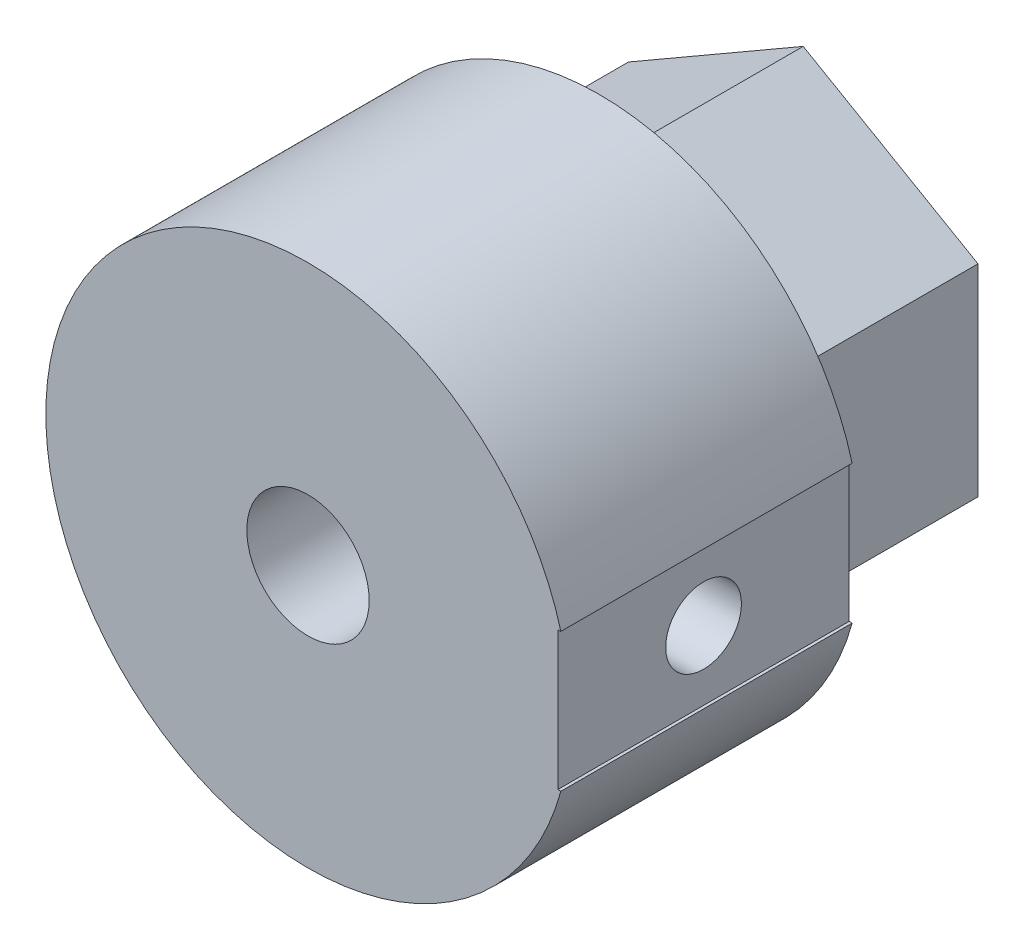
ISO-10303-21;
HEADER;
FILE_DESCRIPTION(('STEP AP214'),'2;1');
FILE_NAME('part.step','',(''),(''),'','','');
FILE_SCHEMA(('AUTOMOTIVE_DESIGN { 1 0 10303 214 1 1 1 1 }'));
ENDSEC;
DATA;
#1=APPLICATION_CONTEXT('core data for automotive mechanical design processes');
#2=APPLICATION_PROTOCOL_DEFINITION('international standard','automotive_design',2000,#1);
#3=PRODUCT_CONTEXT('',#1,'mechanical');
#4=PRODUCT('Part','Part','',(#3));
#5=PRODUCT_RELATED_PRODUCT_CATEGORY('part','',(#4));
#6=PRODUCT_DEFINITION_FORMATION('','',#4);
#7=PRODUCT_DEFINITION_CONTEXT('part definition',#1,'design');
#8=PRODUCT_DEFINITION('design','',#6,#7);
#9=PRODUCT_DEFINITION_SHAPE('','',#8);
#10=(LENGTH_UNIT() NAMED_UNIT(*) SI_UNIT(.MILLI.,.METRE.));
#11=(NAMED_UNIT(*) PLANE_ANGLE_UNIT() SI_UNIT($,.RADIAN.));
#12=(NAMED_UNIT(*) SI_UNIT($,.STERADIAN.) SOLID_ANGLE_UNIT());
#13=UNCERTAINTY_MEASURE_WITH_UNIT(LENGTH_MEASURE(1.E-05),#10,'distance_accuracy_value','');
#14=(GEOMETRIC_REPRESENTATION_CONTEXT(3) GLOBAL_UNCERTAINTY_ASSIGNED_CONTEXT((#13)) GLOBAL_UNIT_ASSIGNED_CONTEXT((#10,
#11,#12)) REPRESENTATION_CONTEXT('',''));
#15=CARTESIAN_POINT('',(0.,0.,0.));
#16=DIRECTION('',(0.,0.,1.));
#17=DIRECTION('',(1.,0.,0.));
#18=AXIS2_PLACEMENT_3D('',#15,#16,#17);
#19=CARTESIAN_POINT('',(0.,0.,0.));
#20=DIRECTION('',(0.,0.,1.));
#21=DIRECTION('',(1.,0.,0.));
#22=AXIS2_PLACEMENT_3D('',#19,#20,#21);
#23=CYLINDRICAL_SURFACE('',#22,1.3);
#24=CARTESIAN_POINT('',(0.,0.,0.));
#25=DIRECTION('',(0.,0.,1.));
#26=DIRECTION('',(1.,0.,0.));
#27=AXIS2_PLACEMENT_3D('',#24,#25,#26);
#28=CIRCLE('',#27,1.3);
#29=CARTESIAN_POINT('',(1.3,0.,0.));
#30=VERTEX_POINT('',#29);
#31=EDGE_CURVE('E163',#30,#30,#28,.T.);
#32=ORIENTED_EDGE('',*,*,#31,.F.);
#33=EDGE_LOOP('',(#32));
#34=FACE_BOUND('',#33,.T.);
#35=CARTESIAN_POINT('',(0.,0.,7.));
#36=DIRECTION('',(0.,0.,1.));
#37=DIRECTION('',(1.,0.,0.));
#38=AXIS2_PLACEMENT_3D('',#35,#36,#37);
#39=CIRCLE('',#38,1.3);
#40=CARTESIAN_POINT('',(1.3,0.,7.));
#41=VERTEX_POINT('',#40);
#42=EDGE_CURVE('E37',#41,#41,#39,.F.);
#43=ORIENTED_EDGE('',*,*,#42,.F.);
#44=EDGE_LOOP('',(#43));
#45=FACE_BOUND('',#44,.T.);
#46=ADVANCED_FACE('F33',(#34,#45),#23,.F.);
#47=CARTESIAN_POINT('',(6.,-3.46410161513775,17.));
#48=DIRECTION('',(-1.,0.,0.));
#49=DIRECTION('',(0.,-1.,0.));
#50=AXIS2_PLACEMENT_3D('',#47,#48,#49);
#51=PLANE('',#50);
#52=DIRECTION('',(0.,1.,0.));
#53=VECTOR('',#52,1.);
#54=CARTESIAN_POINT('',(6.,-3.46410161513775,7.));
#55=LINE('',#54,#53);
#56=CARTESIAN_POINT('',(6.,-3.46410161513775,7.));
#57=VERTEX_POINT('',#56);
#58=CARTESIAN_POINT('',(6.,3.46410161513775,7.));
#59=VERTEX_POINT('',#58);
#60=EDGE_CURVE('E160',#57,#59,#55,.T.);
#61=ORIENTED_EDGE('',*,*,#60,.F.);
#62=DIRECTION('',(0.,0.,-1.));
#63=VECTOR('',#62,1.);
#64=CARTESIAN_POINT('',(6.,-3.46410161513775,17.));
#65=LINE('',#64,#63);
#66=CARTESIAN_POINT('',(6.,-3.46410161513775,0.));
#67=VERTEX_POINT('',#66);
#68=EDGE_CURVE('E184',#57,#67,#65,.T.);
#69=ORIENTED_EDGE('',*,*,#68,.T.);
#70=DIRECTION('',(0.,1.,0.));
#71=VECTOR('',#70,1.);
#72=CARTESIAN_POINT('',(6.,-3.46410161513775,0.));
#73=LINE('',#72,#71);
#74=CARTESIAN_POINT('',(6.,3.46410161513775,0.));
#75=VERTEX_POINT('',#74);
#76=EDGE_CURVE('E166',#67,#75,#73,.T.);
#77=ORIENTED_EDGE('',*,*,#76,.T.);
#78=DIRECTION('',(0.,0.,-1.));
#79=VECTOR('',#78,1.);
#80=CARTESIAN_POINT('',(6.,3.46410161513775,17.));
#81=LINE('',#80,#79);
#82=EDGE_CURVE('E194',#59,#75,#81,.T.);
#83=ORIENTED_EDGE('',*,*,#82,.F.);
#84=EDGE_LOOP('',(#61,#69,#77,#83));
#85=FACE_BOUND('',#84,.T.);
#86=ADVANCED_FACE('F35',(#85),#51,.F.);
#87=CARTESIAN_POINT('',(6.,3.46410161513775,17.));
#88=DIRECTION('',(-0.5,-0.866025403784439,0.));
#89=DIRECTION('',(0.866025403784439,-0.5,0.));
#90=AXIS2_PLACEMENT_3D('',#87,#88,#89);
#91=PLANE('',#90);
#92=DIRECTION('',(-0.866025403784439,0.5,0.));
#93=VECTOR('',#92,1.);
#94=CARTESIAN_POINT('',(6.,3.46410161513775,7.));
#95=LINE('',#94,#93);
#96=CARTESIAN_POINT('',(0.,6.92820323027551,7.));
#97=VERTEX_POINT('',#96);
#98=EDGE_CURVE('E58',#59,#97,#95,.T.);
#99=ORIENTED_EDGE('',*,*,#98,.F.);
#100=ORIENTED_EDGE('',*,*,#82,.T.);
#101=DIRECTION('',(-0.866025403784439,0.5,0.));
#102=VECTOR('',#101,1.);
#103=CARTESIAN_POINT('',(6.,3.46410161513775,0.));
#104=LINE('',#103,#102);
#105=CARTESIAN_POINT('',(0.,6.92820323027551,0.));
#106=VERTEX_POINT('',#105);
#107=EDGE_CURVE('E169',#75,#106,#104,.T.);
#108=ORIENTED_EDGE('',*,*,#107,.T.);
#109=DIRECTION('',(0.,0.,-1.));
#110=VECTOR('',#109,1.);
#111=CARTESIAN_POINT('',(0.,6.92820323027551,17.));
#112=LINE('',#111,#110);
#113=EDGE_CURVE('E192',#97,#106,#112,.T.);
#114=ORIENTED_EDGE('',*,*,#113,.F.);
#115=EDGE_LOOP('',(#99,#100,#108,#114));
#116=FACE_BOUND('',#115,.T.);
#117=ADVANCED_FACE('F261',(#116),#91,.F.);
#118=CARTESIAN_POINT('',(0.,6.92820323027551,17.));
#119=DIRECTION('',(0.5,-0.866025403784439,0.));
#120=DIRECTION('',(0.866025403784439,0.5,0.));
#121=AXIS2_PLACEMENT_3D('',#118,#119,#120);
#122=PLANE('',#121);
#123=DIRECTION('',(-0.866025403784439,-0.5,0.));
#124=VECTOR('',#123,1.);
#125=CARTESIAN_POINT('',(0.,6.92820323027551,7.));
#126=LINE('',#125,#124);
#127=CARTESIAN_POINT('',(-6.,3.46410161513775,7.));
#128=VERTEX_POINT('',#127);
#129=EDGE_CURVE('E156',#97,#128,#126,.T.);
#130=ORIENTED_EDGE('',*,*,#129,.F.);
#131=ORIENTED_EDGE('',*,*,#113,.T.);
#132=DIRECTION('',(-0.866025403784439,-0.5,0.));
#133=VECTOR('',#132,1.);
#134=CARTESIAN_POINT('',(0.,6.92820323027551,0.));
#135=LINE('',#134,#133);
#136=CARTESIAN_POINT('',(-6.,3.46410161513775,0.));
#137=VERTEX_POINT('',#136);
#138=EDGE_CURVE('E172',#106,#137,#135,.T.);
#139=ORIENTED_EDGE('',*,*,#138,.T.);
#140=DIRECTION('',(0.,0.,-1.));
#141=VECTOR('',#140,1.);
#142=CARTESIAN_POINT('',(-6.,3.46410161513775,17.));
#143=LINE('',#142,#141);
#144=EDGE_CURVE('E190',#128,#137,#143,.T.);
#145=ORIENTED_EDGE('',*,*,#144,.F.);
#146=EDGE_LOOP('',(#130,#131,#139,#145));
#147=FACE_BOUND('',#146,.T.);
#148=ADVANCED_FACE('F258',(#147),#122,.F.);
#149=CARTESIAN_POINT('',(-6.,3.46410161513775,17.));
#150=DIRECTION('',(1.,0.,0.));
#151=DIRECTION('',(0.,1.,0.));
#152=AXIS2_PLACEMENT_3D('',#149,#150,#151);
#153=PLANE('',#152);
#154=DIRECTION('',(0.,-1.,0.));
#155=VECTOR('',#154,1.);
#156=CARTESIAN_POINT('',(-6.,3.46410161513775,7.));
#157=LINE('',#156,#155);
#158=CARTESIAN_POINT('',(-6.,-3.46410161513776,7.));
#159=VERTEX_POINT('',#158);
#160=EDGE_CURVE('E153',#128,#159,#157,.T.);
#161=ORIENTED_EDGE('',*,*,#160,.F.);
#162=ORIENTED_EDGE('',*,*,#144,.T.);
#163=DIRECTION('',(0.,-1.,0.));
#164=VECTOR('',#163,1.);
#165=CARTESIAN_POINT('',(-6.,3.46410161513775,0.));
#166=LINE('',#165,#164);
#167=CARTESIAN_POINT('',(-6.,-3.46410161513776,0.));
#168=VERTEX_POINT('',#167);
#169=EDGE_CURVE('E175',#137,#168,#166,.T.);
#170=ORIENTED_EDGE('',*,*,#169,.T.);
#171=DIRECTION('',(0.,0.,-1.));
#172=VECTOR('',#171,1.);
#173=CARTESIAN_POINT('',(-6.,-3.46410161513776,17.));
#174=LINE('',#173,#172);
#175=EDGE_CURVE('E188',#159,#168,#174,.T.);
#176=ORIENTED_EDGE('',*,*,#175,.F.);
#177=EDGE_LOOP('',(#161,#162,#170,#176));
#178=FACE_BOUND('',#177,.T.);
#179=ADVANCED_FACE('F254',(#178),#153,.F.);
#180=CARTESIAN_POINT('',(-6.,-3.46410161513776,17.));
#181=DIRECTION('',(0.5,0.866025403784439,0.));
#182=DIRECTION('',(-0.866025403784439,0.5,0.));
#183=AXIS2_PLACEMENT_3D('',#180,#181,#182);
#184=PLANE('',#183);
#185=DIRECTION('',(0.866025403784439,-0.5,0.));
#186=VECTOR('',#185,1.);
#187=CARTESIAN_POINT('',(-6.,-3.46410161513776,7.));
#188=LINE('',#187,#186);
#189=CARTESIAN_POINT('',(0.,-6.92820323027551,7.));
#190=VERTEX_POINT('',#189);
#191=EDGE_CURVE('E150',#159,#190,#188,.T.);
#192=ORIENTED_EDGE('',*,*,#191,.F.);
#193=ORIENTED_EDGE('',*,*,#175,.T.);
#194=DIRECTION('',(0.866025403784439,-0.5,0.));
#195=VECTOR('',#194,1.);
#196=CARTESIAN_POINT('',(-6.,-3.46410161513776,0.));
#197=LINE('',#196,#195);
#198=CARTESIAN_POINT('',(0.,-6.92820323027551,0.));
#199=VERTEX_POINT('',#198);
#200=EDGE_CURVE('E178',#168,#199,#197,.T.);
#201=ORIENTED_EDGE('',*,*,#200,.T.);
#202=DIRECTION('',(0.,0.,-1.));
#203=VECTOR('',#202,1.);
#204=CARTESIAN_POINT('',(0.,-6.92820323027551,17.));
#205=LINE('',#204,#203);
#206=EDGE_CURVE('E186',#190,#199,#205,.T.);
#207=ORIENTED_EDGE('',*,*,#206,.F.);
#208=EDGE_LOOP('',(#192,#193,#201,#207));
#209=FACE_BOUND('',#208,.T.);
#210=ADVANCED_FACE('F250',(#209),#184,.F.);
#211=CARTESIAN_POINT('',(0.,-6.92820323027551,17.));
#212=DIRECTION('',(-0.5,0.866025403784439,0.));
#213=DIRECTION('',(-0.866025403784439,-0.5,0.));
#214=AXIS2_PLACEMENT_3D('',#211,#212,#213);
#215=PLANE('',#214);
#216=DIRECTION('',(0.866025403784439,0.5,0.));
#217=VECTOR('',#216,1.);
#218=CARTESIAN_POINT('',(0.,-6.92820323027551,7.));
#219=LINE('',#218,#217);
#220=EDGE_CURVE('E146',#190,#57,#219,.T.);
#221=ORIENTED_EDGE('',*,*,#220,.F.);
#222=ORIENTED_EDGE('',*,*,#206,.T.);
#223=DIRECTION('',(0.866025403784439,0.5,0.));
#224=VECTOR('',#223,1.);
#225=CARTESIAN_POINT('',(0.,-6.92820323027551,0.));
#226=LINE('',#225,#224);
#227=EDGE_CURVE('E181',#199,#67,#226,.T.);
#228=ORIENTED_EDGE('',*,*,#227,.T.);
#229=ORIENTED_EDGE('',*,*,#68,.F.);
#230=EDGE_LOOP('',(#221,#222,#228,#229));
#231=FACE_BOUND('',#230,.T.);
#232=ADVANCED_FACE('F243',(#231),#215,.F.);
#233=CARTESIAN_POINT('',(0.,0.,17.));
#234=DIRECTION('',(0.,0.,1.));
#235=DIRECTION('',(1.,0.,0.));
#236=AXIS2_PLACEMENT_3D('',#233,#234,#235);
#237=PLANE('',#236);
#238=CARTESIAN_POINT('',(0.,0.,17.));
#239=DIRECTION('',(0.,0.,1.));
#240=DIRECTION('',(1.,0.,0.));
#241=AXIS2_PLACEMENT_3D('',#238,#239,#240);
#242=CIRCLE('',#241,2.1);
#243=CARTESIAN_POINT('',(2.1,0.,17.));
#244=VERTEX_POINT('',#243);
#245=EDGE_CURVE('E221',#244,#244,#242,.T.);
#246=ORIENTED_EDGE('',*,*,#245,.F.);
#247=EDGE_LOOP('',(#246));
#248=FACE_BOUND('',#247,.T.);
#249=DIRECTION('',(1.,0.,0.));
#250=VECTOR('',#249,1.);
#251=CARTESIAN_POINT('',(8.57868638007796,-2.37573749863627,17.));
#252=LINE('',#251,#250);
#253=CARTESIAN_POINT('',(8.57868638007796,-2.37573749863627,17.));
#254=VERTEX_POINT('',#253);
#255=CARTESIAN_POINT('',(8.68077596402381,-2.37573749863627,17.));
#256=VERTEX_POINT('',#255);
#257=EDGE_CURVE('E121',#254,#256,#252,.T.);
#258=ORIENTED_EDGE('',*,*,#257,.F.);
#259=DIRECTION('',(0.,-1.,0.));
#260=VECTOR('',#259,1.);
#261=CARTESIAN_POINT('',(8.57868638007796,-2.37573749863627,17.));
#262=LINE('',#261,#260);
#263=CARTESIAN_POINT('',(8.57868638007796,2.37573749863626,17.));
#264=VERTEX_POINT('',#263);
#265=EDGE_CURVE('E118',#264,#254,#262,.T.);
#266=ORIENTED_EDGE('',*,*,#265,.F.);
#267=DIRECTION('',(-1.,0.,0.));
#268=VECTOR('',#267,1.);
#269=CARTESIAN_POINT('',(8.57868638007796,2.37573749863626,17.));
#270=LINE('',#269,#268);
#271=CARTESIAN_POINT('',(8.68077596402381,2.37573749863626,17.));
#272=VERTEX_POINT('',#271);
#273=EDGE_CURVE('E124',#272,#264,#270,.T.);
#274=ORIENTED_EDGE('',*,*,#273,.F.);
#275=CARTESIAN_POINT('',(0.,0.,17.));
#276=DIRECTION('',(0.,0.,1.));
#277=DIRECTION('',(1.,0.,0.));
#278=AXIS2_PLACEMENT_3D('',#275,#276,#277);
#279=CIRCLE('',#278,9.);
#280=EDGE_CURVE('E142',#272,#256,#279,.T.);
#281=ORIENTED_EDGE('',*,*,#280,.T.);
#282=EDGE_LOOP('',(#258,#266,#274,#281));
#283=FACE_BOUND('',#282,.T.);
#284=ADVANCED_FACE('F132',(#248,#283),#237,.T.);
#285=CARTESIAN_POINT('',(0.,0.,0.));
#286=DIRECTION('',(0.,0.,1.));
#287=DIRECTION('',(1.,0.,0.));
#288=AXIS2_PLACEMENT_3D('',#285,#286,#287);
#289=PLANE('',#288);
#290=ORIENTED_EDGE('',*,*,#31,.T.);
#291=EDGE_LOOP('',(#290));
#292=FACE_BOUND('',#291,.T.);
#293=ORIENTED_EDGE('',*,*,#76,.F.);
#294=ORIENTED_EDGE('',*,*,#227,.F.);
#295=ORIENTED_EDGE('',*,*,#200,.F.);
#296=ORIENTED_EDGE('',*,*,#169,.F.);
#297=ORIENTED_EDGE('',*,*,#138,.F.);
#298=ORIENTED_EDGE('',*,*,#107,.F.);
#299=EDGE_LOOP('',(#293,#294,#295,#296,#297,#298));
#300=FACE_BOUND('',#299,.T.);
#301=ADVANCED_FACE('F242',(#292,#300),#289,.F.);
#302=CARTESIAN_POINT('',(0.,0.,7.));
#303=DIRECTION('',(0.,0.,1.));
#304=DIRECTION('',(1.,0.,0.));
#305=AXIS2_PLACEMENT_3D('',#302,#303,#304);
#306=PLANE('',#305);
#307=DIRECTION('',(0.,-1.,0.));
#308=VECTOR('',#307,1.);
#309=CARTESIAN_POINT('',(8.57868638007796,0.,7.));
#310=LINE('',#309,#308);
#311=CARTESIAN_POINT('',(8.57868638007796,2.37573749863626,7.));
#312=VERTEX_POINT('',#311);
#313=CARTESIAN_POINT('',(8.57868638007796,-2.37573749863627,7.));
#314=VERTEX_POINT('',#313);
#315=EDGE_CURVE('E11',#312,#314,#310,.T.);
#316=ORIENTED_EDGE('',*,*,#315,.T.);
#317=DIRECTION('',(1.,0.,0.));
#318=VECTOR('',#317,1.);
#319=CARTESIAN_POINT('',(0.,-2.37573749863627,7.));
#320=LINE('',#319,#318);
#321=CARTESIAN_POINT('',(8.68077596402381,-2.37573749863627,7.));
#322=VERTEX_POINT('',#321);
#323=EDGE_CURVE('E139',#314,#322,#320,.T.);
#324=ORIENTED_EDGE('',*,*,#323,.T.);
#325=CARTESIAN_POINT('',(0.,0.,7.));
#326=DIRECTION('',(0.,0.,1.));
#327=DIRECTION('',(1.,0.,0.));
#328=AXIS2_PLACEMENT_3D('',#325,#326,#327);
#329=CIRCLE('',#328,9.);
#330=CARTESIAN_POINT('',(8.68077596402381,2.37573749863626,7.));
#331=VERTEX_POINT('',#330);
#332=EDGE_CURVE('E143',#331,#322,#329,.T.);
#333=ORIENTED_EDGE('',*,*,#332,.F.);
#334=DIRECTION('',(-1.,0.,0.));
#335=VECTOR('',#334,1.);
#336=CARTESIAN_POINT('',(0.,2.37573749863626,7.));
#337=LINE('',#336,#335);
#338=EDGE_CURVE('E50',#331,#312,#337,.T.);
#339=ORIENTED_EDGE('',*,*,#338,.T.);
#340=EDGE_LOOP('',(#316,#324,#333,#339));
#341=FACE_BOUND('',#340,.T.);
#342=ORIENTED_EDGE('',*,*,#220,.T.);
#343=ORIENTED_EDGE('',*,*,#60,.T.);
#344=ORIENTED_EDGE('',*,*,#98,.T.);
#345=ORIENTED_EDGE('',*,*,#129,.T.);
#346=ORIENTED_EDGE('',*,*,#160,.T.);
#347=ORIENTED_EDGE('',*,*,#191,.T.);
#348=EDGE_LOOP('',(#342,#343,#344,#345,#346,#347));
#349=FACE_BOUND('',#348,.T.);
#350=ADVANCED_FACE('F234',(#341,#349),#306,.F.);
#351=CARTESIAN_POINT('',(0.,0.,7.));
#352=DIRECTION('',(0.,0.,1.));
#353=DIRECTION('',(1.,0.,0.));
#354=AXIS2_PLACEMENT_3D('',#351,#352,#353);
#355=CYLINDRICAL_SURFACE('',#354,9.);
#356=CARTESIAN_POINT('',(-9.,0.,10.7));
#357=CARTESIAN_POINT('',(-8.99999886685049,-0.0726161825161228,10.7000030179057));
#358=CARTESIAN_POINT('',(-8.99911192088851,-0.145275273356691,10.7061048925621));
#359=CARTESIAN_POINT('',(-8.99565906742254,-0.288564680588738,10.7303462177474));
#360=CARTESIAN_POINT('',(-8.9930914970246,-0.359192915218876,10.7484975909057));
#361=CARTESIAN_POINT('',(-8.98656610157761,-0.49632601369094,10.7962860504916));
#362=CARTESIAN_POINT('',(-8.98260930038149,-0.562833871867999,10.8259146799222));
#363=CARTESIAN_POINT('',(-8.97374334347608,-0.689922979183434,10.8957964288494));
#364=CARTESIAN_POINT('',(-8.96883432739334,-0.750505095276923,10.9360479909805));
#365=CARTESIAN_POINT('',(-8.95857047423112,-0.864473940159738,11.0263448505381));
#366=CARTESIAN_POINT('',(-8.95321294862107,-0.91781137903788,11.076452060509));
#367=CARTESIAN_POINT('',(-8.94267709434867,-1.01535172198024,11.1849046681725));
#368=CARTESIAN_POINT('',(-8.93749877571417,-1.05955411556233,11.2432505259486));
#369=CARTESIAN_POINT('',(-8.92788149846685,-1.13775964079836,11.3668529449778));
#370=CARTESIAN_POINT('',(-8.92344601308425,-1.1717154245872,11.4321397577465));
#371=CARTESIAN_POINT('',(-8.91585306506849,-1.22816132370236,11.5675644894435));
#372=CARTESIAN_POINT('',(-8.91269553787813,-1.25065201821292,11.6377021631165));
#373=CARTESIAN_POINT('',(-8.90804229933286,-1.28337696964788,11.7803207327257));
#374=CARTESIAN_POINT('',(-8.90653518527196,-1.2936953638146,11.8527819439515));
#375=CARTESIAN_POINT('',(-8.90531874187228,-1.30204339248276,11.9984218561183));
#376=CARTESIAN_POINT('',(-8.90560931670267,-1.30007368203592,12.071600518606));
#377=CARTESIAN_POINT('',(-8.9079449895514,-1.28397024472981,12.2160056168021));
#378=CARTESIAN_POINT('',(-8.90997660637288,-1.26992997965499,12.2872427243279));
#379=CARTESIAN_POINT('',(-8.91554440166498,-1.23023017528381,12.4263392258918));
#380=CARTESIAN_POINT('',(-8.91908061985619,-1.20457032923634,12.4941985307051));
#381=CARTESIAN_POINT('',(-8.92727416310496,-1.14226177749905,12.6248989335556));
#382=CARTESIAN_POINT('',(-8.93193553951083,-1.10557324101686,12.6877207787645));
#383=CARTESIAN_POINT('',(-8.94185120777938,-1.02227715681356,12.806351737727));
#384=CARTESIAN_POINT('',(-8.94710553575573,-0.975669004785747,12.8621604239067));
#385=CARTESIAN_POINT('',(-8.95767473328203,-0.873342522317746,12.9657227277226));
#386=CARTESIAN_POINT('',(-8.96298971271745,-0.817543787040452,13.0133969246415));
#387=CARTESIAN_POINT('',(-8.97303606405221,-0.698694761830924,13.0987159186785));
#388=CARTESIAN_POINT('',(-8.97776743372044,-0.635644444178103,13.1363606774553));
#389=CARTESIAN_POINT('',(-8.98611790270109,-0.504014985474141,13.2005553213372));
#390=CARTESIAN_POINT('',(-8.98973641497596,-0.435432950409738,13.2270993534036));
#391=CARTESIAN_POINT('',(-8.99544847162129,-0.294720866423351,13.2682714414607));
#392=CARTESIAN_POINT('',(-8.99754211152437,-0.222591040071334,13.2829002439424));
#393=CARTESIAN_POINT('',(-8.99995593179461,-0.0775166261160494,13.299721642539));
#394=CARTESIAN_POINT('',(-9.00029168947683,-0.0045849542105291,13.3020234771541));
#395=CARTESIAN_POINT('',(-8.99919423576155,0.140623283962609,13.2944151554449));
#396=CARTESIAN_POINT('',(-8.99776107503573,0.212899868935824,13.2845053489299));
#397=CARTESIAN_POINT('',(-8.99329645841354,0.354417411864375,13.2528458689571));
#398=CARTESIAN_POINT('',(-8.99027215249009,0.423670460731398,13.2311491471084));
#399=CARTESIAN_POINT('',(-8.98296337093671,0.55755572157027,13.176587379013));
#400=CARTESIAN_POINT('',(-8.97867883989296,0.622187730193372,13.1437218416486));
#401=CARTESIAN_POINT('',(-8.96928732992692,0.745478388085476,13.0674971952821));
#402=CARTESIAN_POINT('',(-8.96417497293068,0.804093577429591,13.0240684660163));
#403=CARTESIAN_POINT('',(-8.95371432258047,0.913242498234221,12.9280475149851));
#404=CARTESIAN_POINT('',(-8.94836601657276,0.963775795595859,12.8754548013159));
#405=CARTESIAN_POINT('',(-8.93798717240551,1.05572162102025,12.7621136669887));
#406=CARTESIAN_POINT('',(-8.93295939058988,1.09706111033544,12.7013057046283));
#407=CARTESIAN_POINT('',(-8.923838865449,1.16893890037996,12.5735448558142));
#408=CARTESIAN_POINT('',(-8.91974609833166,1.19947747595672,12.5065921257792));
#409=CARTESIAN_POINT('',(-8.91297870028431,1.24877215075929,12.3686643095023));
#410=CARTESIAN_POINT('',(-8.9102993697419,1.26756733516503,12.2977034327738));
#411=CARTESIAN_POINT('',(-8.90664948831333,1.29296647663048,12.1535909265383));
#412=CARTESIAN_POINT('',(-8.9056788287146,1.29957120929749,12.0804394367082));
#413=CARTESIAN_POINT('',(-8.90556004646843,1.30038450985761,11.9347498466062));
#414=CARTESIAN_POINT('',(-8.90639504347657,1.29470789084417,11.862212374777));
#415=CARTESIAN_POINT('',(-8.90975689966459,1.27136497418117,11.719134963244));
#416=CARTESIAN_POINT('',(-8.91228375689653,1.25369869033603,11.6485950212403));
#417=CARTESIAN_POINT('',(-8.91873888003025,1.20691743721873,11.5115429219884));
#418=CARTESIAN_POINT('',(-8.92266623507524,1.17780990785681,11.4450281796397));
#419=CARTESIAN_POINT('',(-8.93148103266923,1.10898377517461,11.3178078654696));
#420=CARTESIAN_POINT('',(-8.93636850293434,1.06926486551846,11.2571024614245));
#421=CARTESIAN_POINT('',(-8.94660732762801,0.979924120983318,11.1426397736083));
#422=CARTESIAN_POINT('',(-8.95196243152711,0.930217100043667,11.088949307888));
#423=CARTESIAN_POINT('',(-8.96250140061062,0.822490977248043,10.9906303225525));
#424=CARTESIAN_POINT('',(-8.96768522558605,0.764469940438544,10.9460039183128));
#425=CARTESIAN_POINT('',(-8.97732749397021,0.641417167729072,10.8668788940298));
#426=CARTESIAN_POINT('',(-8.98178211378627,0.57635127453404,10.8324329411212));
#427=CARTESIAN_POINT('',(-8.98942636807162,0.441325364686636,10.7750089559894));
#428=CARTESIAN_POINT('',(-8.99261732736653,0.371370564617911,10.7520189067925));
#429=CARTESIAN_POINT('',(-8.996636556397,0.250908337539317,10.7234437933782));
#430=CARTESIAN_POINT('',(-8.9978914500348,0.201148595189125,10.7146656130017));
#431=CARTESIAN_POINT('',(-8.99957356107547,0.100932807663756,10.7029426998114));
#432=CARTESIAN_POINT('',(-9.00000078767192,0.0504767702291778,10.6999979022013));
#433=CARTESIAN_POINT('',(-9.,0.,10.7));
#434=B_SPLINE_CURVE_WITH_KNOTS('',3,(#356,#357,#358,#359,#360,#361,#362,#363,#364,#365,#366,
#367,#368,#369,#370,#371,#372,#373,#374,#375,#376,#377,#378,#379,#380,#381,#382,#383,#384,#385,
#386,#387,#388,#389,#390,#391,#392,#393,#394,#395,#396,#397,#398,#399,#400,#401,#402,#403,#404,
#405,#406,#407,#408,#409,#410,#411,#412,#413,#414,#415,#416,#417,#418,#419,#420,#421,#422,#423,
#424,#425,#426,#427,#428,#429,#430,#431,#432,#433),.UNSPECIFIED.,.T.,.F.,(4,2,2,2,2,2,2,2,2,2,2,
2,2,2,2,2,2,2,2,2,2,2,2,2,2,2,2,2,2,2,2,2,2,2,2,2,2,2,4),(0.,0.217664117538774,
0.435543929073118,0.653263500685468,0.870951171430813,1.09005272939449,1.30916652782326,
1.52927783394998,1.74937801956735,1.96794774674852,2.18650582255975,2.40338669936716,
2.62027330205483,2.83795281203511,3.05564558693095,3.27535528243951,3.49506581785914,
3.71489205361864,3.93470451616961,4.15256579262199,4.37042082845834,4.58730516812196,
4.80419904590827,5.02256313228882,5.24093894362098,5.46099211648742,5.6810396893273,
5.90035092758197,6.11964821186121,6.33690424452957,6.55416002705854,6.7712747675501,
6.98839577652115,7.20745379436975,7.42656287750508,7.64678640856551,7.86677844144403,
8.01808223229383,8.16938434247709),.UNSPECIFIED.);
#435=CARTESIAN_POINT('',(-9.,0.,10.7));
#436=VERTEX_POINT('',#435);
#437=EDGE_CURVE('E130',#436,#436,#434,.T.);
#438=ORIENTED_EDGE('',*,*,#437,.F.);
#439=EDGE_LOOP('',(#438));
#440=FACE_BOUND('',#439,.T.);
#441=DIRECTION('',(0.,0.,1.));
#442=VECTOR('',#441,1.);
#443=CARTESIAN_POINT('',(8.68077596402381,-2.37573749863627,7.));
#444=LINE('',#443,#442);
#445=EDGE_CURVE('E42',#256,#322,#444,.F.);
#446=ORIENTED_EDGE('',*,*,#445,.F.);
#447=ORIENTED_EDGE('',*,*,#280,.F.);
#448=DIRECTION('',(0.,0.,1.));
#449=VECTOR('',#448,1.);
#450=CARTESIAN_POINT('',(8.68077596402381,2.37573749863626,7.));
#451=LINE('',#450,#449);
#452=EDGE_CURVE('E126',#331,#272,#451,.T.);
#453=ORIENTED_EDGE('',*,*,#452,.F.);
#454=ORIENTED_EDGE('',*,*,#332,.T.);
#455=EDGE_LOOP('',(#446,#447,#453,#454));
#456=FACE_BOUND('',#455,.T.);
#457=ADVANCED_FACE('F229',(#440,#456),#355,.T.);
#458=CARTESIAN_POINT('',(8.57868638007796,-2.37573749863627,5.));
#459=DIRECTION('',(-1.,0.,0.));
#460=DIRECTION('',(0.,0.,1.));
#461=AXIS2_PLACEMENT_3D('',#458,#459,#460);
#462=PLANE('',#461);
#463=CARTESIAN_POINT('',(8.57868638007796,0.,12.));
#464=DIRECTION('',(1.,0.,0.));
#465=DIRECTION('',(0.,0.,-1.));
#466=AXIS2_PLACEMENT_3D('',#463,#464,#465);
#467=CIRCLE('',#466,1.3);
#468=CARTESIAN_POINT('',(8.57868638007796,0.,10.7));
#469=VERTEX_POINT('',#468);
#470=EDGE_CURVE('E223',#469,#469,#467,.T.);
#471=ORIENTED_EDGE('',*,*,#470,.F.);
#472=EDGE_LOOP('',(#471));
#473=FACE_BOUND('',#472,.T.);
#474=DIRECTION('',(0.,0.,1.));
#475=VECTOR('',#474,1.);
#476=CARTESIAN_POINT('',(8.57868638007796,2.37573749863626,5.));
#477=LINE('',#476,#475);
#478=EDGE_CURVE('E113',#312,#264,#477,.T.);
#479=ORIENTED_EDGE('',*,*,#478,.T.);
#480=ORIENTED_EDGE('',*,*,#265,.T.);
#481=DIRECTION('',(0.,0.,1.));
#482=VECTOR('',#481,1.);
#483=CARTESIAN_POINT('',(8.57868638007796,-2.37573749863627,5.));
#484=LINE('',#483,#482);
#485=EDGE_CURVE('E120',#314,#254,#484,.T.);
#486=ORIENTED_EDGE('',*,*,#485,.F.);
#487=ORIENTED_EDGE('',*,*,#315,.F.);
#488=EDGE_LOOP('',(#479,#480,#486,#487));
#489=FACE_BOUND('',#488,.T.);
#490=ADVANCED_FACE('F115',(#473,#489),#462,.F.);
#491=CARTESIAN_POINT('',(8.57868638007796,-2.37573749863627,5.));
#492=DIRECTION('',(0.,-1.,0.));
#493=DIRECTION('',(0.,0.,-1.));
#494=AXIS2_PLACEMENT_3D('',#491,#492,#493);
#495=PLANE('',#494);
#496=ORIENTED_EDGE('',*,*,#485,.T.);
#497=ORIENTED_EDGE('',*,*,#257,.T.);
#498=ORIENTED_EDGE('',*,*,#445,.T.);
#499=ORIENTED_EDGE('',*,*,#323,.F.);
#500=EDGE_LOOP('',(#496,#497,#498,#499));
#501=FACE_BOUND('',#500,.T.);
#502=ADVANCED_FACE('F290',(#501),#495,.F.);
#503=CARTESIAN_POINT('',(8.57868638007796,2.37573749863626,5.));
#504=DIRECTION('',(0.,1.,0.));
#505=DIRECTION('',(0.,0.,1.));
#506=AXIS2_PLACEMENT_3D('',#503,#504,#505);
#507=PLANE('',#506);
#508=ORIENTED_EDGE('',*,*,#452,.T.);
#509=ORIENTED_EDGE('',*,*,#273,.T.);
#510=ORIENTED_EDGE('',*,*,#478,.F.);
#511=ORIENTED_EDGE('',*,*,#338,.F.);
#512=EDGE_LOOP('',(#508,#509,#510,#511));
#513=FACE_BOUND('',#512,.T.);
#514=ADVANCED_FACE('F125',(#513),#507,.F.);
#515=CARTESIAN_POINT('',(-18.421313619922,0.,12.));
#516=DIRECTION('',(1.,0.,0.));
#517=DIRECTION('',(0.,0.,-1.));
#518=AXIS2_PLACEMENT_3D('',#515,#516,#517);
#519=CYLINDRICAL_SURFACE('',#518,1.3);
#520=CARTESIAN_POINT('',(2.1,0.,10.7));
#521=CARTESIAN_POINT('',(2.09999592521546,-0.0661584725627303,10.7000043961658));
#522=CARTESIAN_POINT('',(2.09684060553243,-0.132402130105004,10.7050847768142));
#523=CARTESIAN_POINT('',(2.08451827939458,-0.262867337890483,10.725136611613));
#524=CARTESIAN_POINT('',(2.07533898847571,-0.327084474454252,10.7401282779496));
#525=CARTESIAN_POINT('',(2.05189322117352,-0.451346237081739,10.7791368058104));
#526=CARTESIAN_POINT('',(2.0376519641904,-0.511409815716775,10.8031089567296));
#527=CARTESIAN_POINT('',(2.00527459730511,-0.626458725437602,10.8591025195503));
#528=CARTESIAN_POINT('',(1.98713904260172,-0.68144477881516,10.8911227841663));
#529=CARTESIAN_POINT('',(1.94678563978927,-0.789696194975881,10.9651026622645));
#530=CARTESIAN_POINT('',(1.9243583816122,-0.84248165952136,11.0076480185819));
#531=CARTESIAN_POINT('',(1.87833767537554,-0.940634354069636,11.1001317779659));
#532=CARTESIAN_POINT('',(1.85474270535462,-0.985991552019143,11.1500800082756));
#533=CARTESIAN_POINT('',(1.80531777127424,-1.07410438743368,11.2637027032458));
#534=CARTESIAN_POINT('',(1.779605262846,-1.11572137091706,11.3283189100844));
#535=CARTESIAN_POINT('',(1.73262362597647,-1.18737398590676,11.4651356694186));
#536=CARTESIAN_POINT('',(1.71134708052571,-1.2174290214935,11.5373232536066));
#537=CARTESIAN_POINT('',(1.68134345669534,-1.25839481688526,11.6685106655202));
#538=CARTESIAN_POINT('',(1.67079969270136,-1.27223321559787,11.7261782753493));
#539=CARTESIAN_POINT('',(1.65562458660159,-1.29192385809486,11.8435909393596));
#540=CARTESIAN_POINT('',(1.6509851417835,-1.2977870473124,11.9033330306621));
#541=CARTESIAN_POINT('',(1.64831399449792,-1.30117913497181,12.023353921851));
#542=CARTESIAN_POINT('',(1.650298494561,-1.29868759722699,12.0836336775456));
#543=CARTESIAN_POINT('',(1.66059504849629,-1.28549195135012,12.2027508001185));
#544=CARTESIAN_POINT('',(1.66891210560678,-1.27478134943217,12.2615869885009));
#545=CARTESIAN_POINT('',(1.69046533177965,-1.2460485951576,12.3751371428163));
#546=CARTESIAN_POINT('',(1.70359821016581,-1.22817928885749,12.4299105458169));
#547=CARTESIAN_POINT('',(1.73334848680728,-1.18582100265141,12.5358029705517));
#548=CARTESIAN_POINT('',(1.74996712642503,-1.16132966358154,12.5869206816873));
#549=CARTESIAN_POINT('',(1.78851004522184,-1.10123842568689,12.6940527847813));
#550=CARTESIAN_POINT('',(1.81084788027945,-1.06442362438144,12.7492368187148));
#551=CARTESIAN_POINT('',(1.85629507893708,-0.983029068737411,12.8532417239369));
#552=CARTESIAN_POINT('',(1.87940520461858,-0.938441449791713,12.9020560619903));
#553=CARTESIAN_POINT('',(1.92810000853828,-0.834401999779437,12.9998206715178));
#554=CARTESIAN_POINT('',(1.95349586016988,-0.773714262903837,13.0475646930291));
#555=CARTESIAN_POINT('',(2.00010846364422,-0.643682245250705,13.1321112341572));
#556=CARTESIAN_POINT('',(2.02132702082652,-0.574341725288912,13.1689184839369));
#557=CARTESIAN_POINT('',(2.05613988742858,-0.432774004204631,13.2281085116787));
#558=CARTESIAN_POINT('',(2.07009764548966,-0.360932102004449,13.251189586685));
#559=CARTESIAN_POINT('',(2.09045648949532,-0.213340794412893,13.2845964242982));
#560=CARTESIAN_POINT('',(2.09686786640824,-0.137596857776656,13.2949395584756));
#561=CARTESIAN_POINT('',(2.10100954931623,0.00364574233685075,13.3016306005272));
#562=CARTESIAN_POINT('',(2.09986668621279,0.0690324995168252,13.299794985612));
#563=CARTESIAN_POINT('',(2.09160955950657,0.198412601743832,13.2864132655175));
#564=CARTESIAN_POINT('',(2.0844956249399,0.262406023371326,13.2748676954057));
#565=CARTESIAN_POINT('',(2.06531369218127,0.384963315348098,13.243250195414));
#566=CARTESIAN_POINT('',(2.05342982398813,0.443639171616895,13.2234942953285));
#567=CARTESIAN_POINT('',(2.02567947304524,0.556794406547206,13.1763250013745));
#568=CARTESIAN_POINT('',(2.00981229843835,0.611273054048564,13.1489102771577));
#569=CARTESIAN_POINT('',(1.97345239108384,0.720505271244242,13.0841156277793));
#570=CARTESIAN_POINT('',(1.95265315186718,0.774721787232748,13.0460051619812));
#571=CARTESIAN_POINT('',(1.90919420888488,0.876379353473649,12.9624432533545));
#572=CARTESIAN_POINT('',(1.88653241856703,0.923812637189165,12.9169835207342));
#573=CARTESIAN_POINT('',(1.83788313646233,1.01752104249958,12.8125570679735));
#574=CARTESIAN_POINT('',(1.81187976970112,1.06267797965709,12.7525891181582));
#575=CARTESIAN_POINT('',(1.76269448489136,1.14241133710175,12.6249380577086));
#576=CARTESIAN_POINT('',(1.73951035457789,1.17699608611067,12.5572610782109));
#577=CARTESIAN_POINT('',(1.70362536290001,1.22817932132415,12.4303601806562));
#578=CARTESIAN_POINT('',(1.68974403952521,1.24703650071823,12.3723857807263));
#579=CARTESIAN_POINT('',(1.66757463476793,1.27653464213191,12.2533847199087));
#580=CARTESIAN_POINT('',(1.65927801540467,1.28718814965729,12.1923628721494));
#581=CARTESIAN_POINT('',(1.64950811242235,1.29968919987,12.0685310506595));
#582=CARTESIAN_POINT('',(1.64807041440746,1.30149081843374,12.0057134487702));
#583=CARTESIAN_POINT('',(1.65236889715727,1.29602729484261,11.8807099122547));
#584=CARTESIAN_POINT('',(1.6581079322827,1.28875854518487,11.818524238881));
#585=CARTESIAN_POINT('',(1.67516180076998,1.26649394182726,11.7011595894318));
#586=CARTESIAN_POINT('',(1.68604312286178,1.25209527634885,11.6457992101319));
#587=CARTESIAN_POINT('',(1.71185332936177,1.21656826992095,11.5382962009537));
#588=CARTESIAN_POINT('',(1.72678383925605,1.19543722576171,11.4861548736577));
#589=CARTESIAN_POINT('',(1.76169267541585,1.14348329171373,11.3782752246771));
#590=CARTESIAN_POINT('',(1.78209080507282,1.11169014303098,11.3231422605841));
#591=CARTESIAN_POINT('',(1.82442328827307,1.04076336393811,11.218453163068));
#592=CARTESIAN_POINT('',(1.84635889259501,1.00162371247508,11.1689016577857));
#593=CARTESIAN_POINT('',(1.89419481055175,0.908438907310474,11.0670678666576));
#594=CARTESIAN_POINT('',(1.92005697297959,0.852974653166987,11.0160539601817));
#595=CARTESIAN_POINT('',(1.96890716204202,0.733202497558913,10.9238387510705));
#596=CARTESIAN_POINT('',(1.99189360240549,0.668889755906992,10.8826428528878));
#597=CARTESIAN_POINT('',(2.03242779666648,0.533124186328555,10.8118934694408));
#598=CARTESIAN_POINT('',(2.05001116870187,0.461722412915214,10.7822633736173));
#599=CARTESIAN_POINT('',(2.07780639534474,0.313598477274242,10.7360279802573));
#600=CARTESIAN_POINT('',(2.08804478122851,0.236896572428252,10.7193757854217));
#601=CARTESIAN_POINT('',(2.0959666168779,0.132787795518924,10.7065243922906));
#602=CARTESIAN_POINT('',(2.09747536470714,0.106317484678102,10.7040816940853));
#603=CARTESIAN_POINT('',(2.09949290635766,0.0532360536552061,10.7008185644134));
#604=CARTESIAN_POINT('',(2.10000163986303,0.0266249250767629,10.6999982307998));
#605=CARTESIAN_POINT('',(2.1,0.,10.7));
#606=B_SPLINE_CURVE_WITH_KNOTS('',3,(#520,#521,#522,#523,#524,#525,#526,#527,#528,#529,#530,
#531,#532,#533,#534,#535,#536,#537,#538,#539,#540,#541,#542,#543,#544,#545,#546,#547,#548,#549,
#550,#551,#552,#553,#554,#555,#556,#557,#558,#559,#560,#561,#562,#563,#564,#565,#566,#567,#568,
#569,#570,#571,#572,#573,#574,#575,#576,#577,#578,#579,#580,#581,#582,#583,#584,#585,#586,#587,
#588,#589,#590,#591,#592,#593,#594,#595,#596,#597,#598,#599,#600,#601,#602,#603,#604,#605),
.UNSPECIFIED.,.T.,.F.,(4,2,2,2,2,2,2,2,2,2,2,2,2,2,2,2,2,2,2,2,2,2,2,2,2,2,2,2,2,2,2,2,2,2,2,2,
2,2,2,2,2,2,4),(0.,0.198363116169746,0.397132009252279,0.594924178298485,0.792688167386638,
1.00609062443112,1.21977895149152,1.46174654516973,1.70330626140175,1.88325702484058,
2.06296056804732,2.24310399773362,2.42338990335228,2.60001582237483,2.77670474920722,
2.98591340260599,3.19533497701005,3.43796992749769,3.68049978490293,3.90930750757823,
4.13780284327625,4.33307002506085,4.52832644734643,4.71667647202039,4.90505923371347,
5.11262746548622,5.32043148398677,5.55770502265288,5.79479115369859,5.98161627839598,
6.1681551293176,6.35566074033783,6.5432409506092,6.71724794188948,6.89132488934404,
7.09110054536295,7.29104065432323,7.52894973445492,7.76698947385764,8.00342456504819,
8.23900125447301,8.3188260204086,8.39865560083014),.UNSPECIFIED.);
#607=CARTESIAN_POINT('',(2.1,0.,10.7));
#608=VERTEX_POINT('',#607);
#609=EDGE_CURVE('E203',#608,#608,#606,.T.);
#610=ORIENTED_EDGE('',*,*,#609,.T.);
#611=EDGE_LOOP('',(#610));
#612=FACE_BOUND('',#611,.T.);
#613=ORIENTED_EDGE('',*,*,#470,.T.);
#614=EDGE_LOOP('',(#613));
#615=FACE_BOUND('',#614,.T.);
#616=ADVANCED_FACE('F296',(#612,#615),#519,.F.);
#617=CARTESIAN_POINT('',(-2.1,0.,10.7));
#618=CARTESIAN_POINT('',(-2.09999592521546,0.0661584725627303,10.7000043961658));
#619=CARTESIAN_POINT('',(-2.09684060553243,0.132402130105004,10.7050847768142));
#620=CARTESIAN_POINT('',(-2.08451827939458,0.262867337890483,10.725136611613));
#621=CARTESIAN_POINT('',(-2.07533898847571,0.327084474454252,10.7401282779496));
#622=CARTESIAN_POINT('',(-2.05189322117352,0.451346237081739,10.7791368058104));
#623=CARTESIAN_POINT('',(-2.0376519641904,0.511409815716775,10.8031089567296));
#624=CARTESIAN_POINT('',(-2.00527459730511,0.626458725437602,10.8591025195503));
#625=CARTESIAN_POINT('',(-1.98713904260172,0.68144477881516,10.8911227841663));
#626=CARTESIAN_POINT('',(-1.94678563978927,0.789696194975881,10.9651026622645));
#627=CARTESIAN_POINT('',(-1.9243583816122,0.84248165952136,11.0076480185819));
#628=CARTESIAN_POINT('',(-1.87833767537554,0.940634354069636,11.1001317779659));
#629=CARTESIAN_POINT('',(-1.85474270535462,0.985991552019143,11.1500800082756));
#630=CARTESIAN_POINT('',(-1.80531777127424,1.07410438743368,11.2637027032458));
#631=CARTESIAN_POINT('',(-1.779605262846,1.11572137091706,11.3283189100844));
#632=CARTESIAN_POINT('',(-1.73262362597647,1.18737398590676,11.4651356694186));
#633=CARTESIAN_POINT('',(-1.71134708052571,1.2174290214935,11.5373232536066));
#634=CARTESIAN_POINT('',(-1.68134345669534,1.25839481688526,11.6685106655202));
#635=CARTESIAN_POINT('',(-1.67079969270136,1.27223321559787,11.7261782753493));
#636=CARTESIAN_POINT('',(-1.65562458660159,1.29192385809486,11.8435909393596));
#637=CARTESIAN_POINT('',(-1.6509851417835,1.2977870473124,11.9033330306621));
#638=CARTESIAN_POINT('',(-1.64831399449792,1.30117913497181,12.023353921851));
#639=CARTESIAN_POINT('',(-1.650298494561,1.29868759722699,12.0836336775456));
#640=CARTESIAN_POINT('',(-1.66059504849629,1.28549195135012,12.2027508001185));
#641=CARTESIAN_POINT('',(-1.66891210560678,1.27478134943217,12.2615869885009));
#642=CARTESIAN_POINT('',(-1.69046533177965,1.2460485951576,12.3751371428163));
#643=CARTESIAN_POINT('',(-1.70359821016581,1.22817928885749,12.4299105458169));
#644=CARTESIAN_POINT('',(-1.73334848680728,1.18582100265141,12.5358029705517));
#645=CARTESIAN_POINT('',(-1.74996712642503,1.16132966358154,12.5869206816873));
#646=CARTESIAN_POINT('',(-1.78851004522184,1.10123842568689,12.6940527847813));
#647=CARTESIAN_POINT('',(-1.81084788027945,1.06442362438144,12.7492368187148));
#648=CARTESIAN_POINT('',(-1.85629507893708,0.983029068737411,12.8532417239369));
#649=CARTESIAN_POINT('',(-1.87940520461858,0.938441449791713,12.9020560619903));
#650=CARTESIAN_POINT('',(-1.92810000853828,0.834401999779437,12.9998206715178));
#651=CARTESIAN_POINT('',(-1.95349586016988,0.773714262903837,13.0475646930291));
#652=CARTESIAN_POINT('',(-2.00010846364422,0.643682245250705,13.1321112341572));
#653=CARTESIAN_POINT('',(-2.02132702082652,0.574341725288912,13.1689184839369));
#654=CARTESIAN_POINT('',(-2.05613988742858,0.432774004204631,13.2281085116787));
#655=CARTESIAN_POINT('',(-2.07009764548966,0.360932102004449,13.251189586685));
#656=CARTESIAN_POINT('',(-2.09045648949532,0.213340794412893,13.2845964242982));
#657=CARTESIAN_POINT('',(-2.09686786640824,0.137596857776656,13.2949395584756));
#658=CARTESIAN_POINT('',(-2.10100954931623,-0.00364574233685075,13.3016306005272));
#659=CARTESIAN_POINT('',(-2.09986668621279,-0.0690324995168252,13.299794985612));
#660=CARTESIAN_POINT('',(-2.09160955950657,-0.198412601743832,13.2864132655175));
#661=CARTESIAN_POINT('',(-2.0844956249399,-0.262406023371326,13.2748676954057));
#662=CARTESIAN_POINT('',(-2.06531369218127,-0.384963315348098,13.243250195414));
#663=CARTESIAN_POINT('',(-2.05342982398813,-0.443639171616895,13.2234942953285));
#664=CARTESIAN_POINT('',(-2.02567947304524,-0.556794406547206,13.1763250013745));
#665=CARTESIAN_POINT('',(-2.00981229843835,-0.611273054048564,13.1489102771577));
#666=CARTESIAN_POINT('',(-1.97345239108384,-0.720505271244242,13.0841156277793));
#667=CARTESIAN_POINT('',(-1.95265315186718,-0.774721787232748,13.0460051619812));
#668=CARTESIAN_POINT('',(-1.90919420888488,-0.876379353473649,12.9624432533545));
#669=CARTESIAN_POINT('',(-1.88653241856703,-0.923812637189165,12.9169835207342));
#670=CARTESIAN_POINT('',(-1.83788313646233,-1.01752104249958,12.8125570679735));
#671=CARTESIAN_POINT('',(-1.81187976970112,-1.06267797965709,12.7525891181582));
#672=CARTESIAN_POINT('',(-1.76269448489136,-1.14241133710175,12.6249380577086));
#673=CARTESIAN_POINT('',(-1.73951035457789,-1.17699608611067,12.5572610782109));
#674=CARTESIAN_POINT('',(-1.70362536290001,-1.22817932132415,12.4303601806562));
#675=CARTESIAN_POINT('',(-1.68974403952521,-1.24703650071823,12.3723857807263));
#676=CARTESIAN_POINT('',(-1.66757463476793,-1.27653464213191,12.2533847199087));
#677=CARTESIAN_POINT('',(-1.65927801540467,-1.28718814965729,12.1923628721494));
#678=CARTESIAN_POINT('',(-1.64950811242235,-1.29968919987,12.0685310506595));
#679=CARTESIAN_POINT('',(-1.64807041440746,-1.30149081843374,12.0057134487702));
#680=CARTESIAN_POINT('',(-1.65236889715727,-1.29602729484261,11.8807099122547));
#681=CARTESIAN_POINT('',(-1.6581079322827,-1.28875854518487,11.818524238881));
#682=CARTESIAN_POINT('',(-1.67516180076998,-1.26649394182726,11.7011595894318));
#683=CARTESIAN_POINT('',(-1.68604312286178,-1.25209527634885,11.6457992101319));
#684=CARTESIAN_POINT('',(-1.71185332936177,-1.21656826992095,11.5382962009537));
#685=CARTESIAN_POINT('',(-1.72678383925605,-1.19543722576171,11.4861548736577));
#686=CARTESIAN_POINT('',(-1.76169267541585,-1.14348329171373,11.3782752246771));
#687=CARTESIAN_POINT('',(-1.78209080507282,-1.11169014303098,11.3231422605841));
#688=CARTESIAN_POINT('',(-1.82442328827307,-1.04076336393811,11.218453163068));
#689=CARTESIAN_POINT('',(-1.84635889259501,-1.00162371247508,11.1689016577857));
#690=CARTESIAN_POINT('',(-1.89419481055175,-0.908438907310474,11.0670678666576));
#691=CARTESIAN_POINT('',(-1.92005697297959,-0.852974653166987,11.0160539601817));
#692=CARTESIAN_POINT('',(-1.96890716204202,-0.733202497558913,10.9238387510705));
#693=CARTESIAN_POINT('',(-1.99189360240549,-0.668889755906992,10.8826428528878));
#694=CARTESIAN_POINT('',(-2.03242779666648,-0.533124186328555,10.8118934694408));
#695=CARTESIAN_POINT('',(-2.05001116870187,-0.461722412915214,10.7822633736173));
#696=CARTESIAN_POINT('',(-2.07780639534474,-0.313598477274242,10.7360279802573));
#697=CARTESIAN_POINT('',(-2.08804478122851,-0.236896572428252,10.7193757854217));
#698=CARTESIAN_POINT('',(-2.0959666168779,-0.132787795518924,10.7065243922906));
#699=CARTESIAN_POINT('',(-2.09747536470714,-0.106317484678102,10.7040816940853));
#700=CARTESIAN_POINT('',(-2.09949290635766,-0.0532360536552061,10.7008185644134));
#701=CARTESIAN_POINT('',(-2.10000163986303,-0.0266249250767629,10.6999982307998));
#702=CARTESIAN_POINT('',(-2.1,0.,10.7));
#703=B_SPLINE_CURVE_WITH_KNOTS('',3,(#617,#618,#619,#620,#621,#622,#623,#624,#625,#626,#627,
#628,#629,#630,#631,#632,#633,#634,#635,#636,#637,#638,#639,#640,#641,#642,#643,#644,#645,#646,
#647,#648,#649,#650,#651,#652,#653,#654,#655,#656,#657,#658,#659,#660,#661,#662,#663,#664,#665,
#666,#667,#668,#669,#670,#671,#672,#673,#674,#675,#676,#677,#678,#679,#680,#681,#682,#683,#684,
#685,#686,#687,#688,#689,#690,#691,#692,#693,#694,#695,#696,#697,#698,#699,#700,#701,#702),
.UNSPECIFIED.,.T.,.F.,(4,2,2,2,2,2,2,2,2,2,2,2,2,2,2,2,2,2,2,2,2,2,2,2,2,2,2,2,2,2,2,2,2,2,2,2,
2,2,2,2,2,2,4),(0.,0.198363116169746,0.397132009252279,0.594924178298485,0.792688167386638,
1.00609062443112,1.21977895149152,1.46174654516973,1.70330626140175,1.88325702484058,
2.06296056804732,2.24310399773362,2.42338990335228,2.60001582237483,2.77670474920722,
2.98591340260599,3.19533497701005,3.43796992749769,3.68049978490293,3.90930750757823,
4.13780284327625,4.33307002506085,4.52832644734643,4.71667647202039,4.90505923371347,
5.11262746548622,5.32043148398677,5.55770502265288,5.79479115369859,5.98161627839598,
6.1681551293176,6.35566074033783,6.5432409506092,6.71724794188948,6.89132488934404,
7.09110054536295,7.29104065432323,7.52894973445492,7.76698947385764,8.00342456504819,
8.23900125447301,8.3188260204086,8.39865560083014),.UNSPECIFIED.);
#704=CARTESIAN_POINT('',(-2.1,0.,10.7));
#705=VERTEX_POINT('',#704);
#706=EDGE_CURVE('E197',#705,#705,#703,.T.);
#707=ORIENTED_EDGE('',*,*,#706,.T.);
#708=EDGE_LOOP('',(#707));
#709=FACE_BOUND('',#708,.T.);
#710=ORIENTED_EDGE('',*,*,#437,.T.);
#711=EDGE_LOOP('',(#710));
#712=FACE_BOUND('',#711,.T.);
#713=ADVANCED_FACE('F205',(#709,#712),#519,.F.);
#714=CARTESIAN_POINT('',(0.,0.,7.));
#715=DIRECTION('',(0.,0.,1.));
#716=DIRECTION('',(1.,0.,0.));
#717=AXIS2_PLACEMENT_3D('',#714,#715,#716);
#718=PLANE('',#717);
#719=CARTESIAN_POINT('',(0.,0.,7.));
#720=DIRECTION('',(0.,0.,1.));
#721=DIRECTION('',(1.,0.,0.));
#722=AXIS2_PLACEMENT_3D('',#719,#720,#721);
#723=CIRCLE('',#722,2.1);
#724=CARTESIAN_POINT('',(2.1,0.,7.));
#725=VERTEX_POINT('',#724);
#726=EDGE_CURVE('E204',#725,#725,#723,.T.);
#727=ORIENTED_EDGE('',*,*,#726,.T.);
#728=EDGE_LOOP('',(#727));
#729=FACE_BOUND('',#728,.T.);
#730=ORIENTED_EDGE('',*,*,#42,.T.);
#731=EDGE_LOOP('',(#730));
#732=FACE_BOUND('',#731,.T.);
#733=ADVANCED_FACE('F212',(#729,#732),#718,.T.);
#734=CARTESIAN_POINT('',(0.,0.,7.));
#735=DIRECTION('',(0.,0.,1.));
#736=DIRECTION('',(1.,0.,0.));
#737=AXIS2_PLACEMENT_3D('',#734,#735,#736);
#738=CYLINDRICAL_SURFACE('',#737,2.1);
#739=ORIENTED_EDGE('',*,*,#706,.F.);
#740=EDGE_LOOP('',(#739));
#741=FACE_BOUND('',#740,.T.);
#742=ORIENTED_EDGE('',*,*,#726,.F.);
#743=EDGE_LOOP('',(#742));
#744=FACE_BOUND('',#743,.T.);
#745=ORIENTED_EDGE('',*,*,#245,.T.);
#746=EDGE_LOOP('',(#745));
#747=FACE_BOUND('',#746,.T.);
#748=ORIENTED_EDGE('',*,*,#609,.F.);
#749=EDGE_LOOP('',(#748));
#750=FACE_BOUND('',#749,.T.);
#751=ADVANCED_FACE('F208',(#741,#744,#747,#750),#738,.F.);
#752=CLOSED_SHELL('',(#46,#86,#117,#148,#179,#210,#232,#284,#301,#350,#457,#490,#502,#514,#616,
#713,#733,#751));
#753=MANIFOLD_SOLID_BREP('B2',#752);
#754=ADVANCED_BREP_SHAPE_REPRESENTATION('',(#18,#753),#14);
#755=SHAPE_DEFINITION_REPRESENTATION(#9,#754);
ENDSEC;
END-ISO-10303-21;
